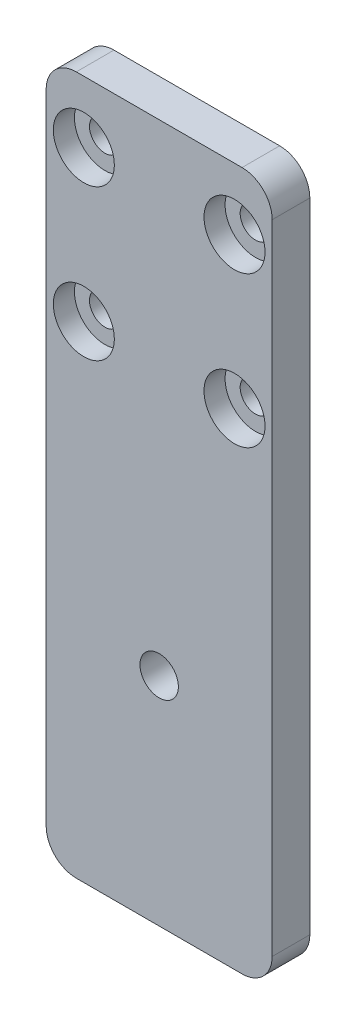
ISO-10303-21;
HEADER;
FILE_DESCRIPTION(('STEP AP214'),'2;1');
FILE_NAME('part.step','',(''),(''),'','','');
FILE_SCHEMA(('AUTOMOTIVE_DESIGN { 1 0 10303 214 1 1 1 1 }'));
ENDSEC;
DATA;
#1=APPLICATION_CONTEXT('core data for automotive mechanical design processes');
#2=APPLICATION_PROTOCOL_DEFINITION('international standard','automotive_design',2000,#1);
#3=PRODUCT_CONTEXT('',#1,'mechanical');
#4=PRODUCT('Part','Part','',(#3));
#5=PRODUCT_RELATED_PRODUCT_CATEGORY('part','',(#4));
#6=PRODUCT_DEFINITION_FORMATION('','',#4);
#7=PRODUCT_DEFINITION_CONTEXT('part definition',#1,'design');
#8=PRODUCT_DEFINITION('design','',#6,#7);
#9=PRODUCT_DEFINITION_SHAPE('','',#8);
#10=(LENGTH_UNIT() NAMED_UNIT(*) SI_UNIT(.MILLI.,.METRE.));
#11=(NAMED_UNIT(*) PLANE_ANGLE_UNIT() SI_UNIT($,.RADIAN.));
#12=(NAMED_UNIT(*) SI_UNIT($,.STERADIAN.) SOLID_ANGLE_UNIT());
#13=UNCERTAINTY_MEASURE_WITH_UNIT(LENGTH_MEASURE(1.E-05),#10,'distance_accuracy_value','');
#14=(GEOMETRIC_REPRESENTATION_CONTEXT(3) GLOBAL_UNCERTAINTY_ASSIGNED_CONTEXT((#13)) GLOBAL_UNIT_ASSIGNED_CONTEXT((#10,
#11,#12)) REPRESENTATION_CONTEXT('',''));
#15=CARTESIAN_POINT('',(0.,0.,0.));
#16=DIRECTION('',(0.,0.,1.));
#17=DIRECTION('',(1.,0.,0.));
#18=AXIS2_PLACEMENT_3D('',#15,#16,#17);
#19=CARTESIAN_POINT('',(25.,66.8,5.));
#20=DIRECTION('',(0.,0.,-1.));
#21=DIRECTION('',(-1.,0.,0.));
#22=AXIS2_PLACEMENT_3D('',#19,#20,#21);
#23=CYLINDRICAL_SURFACE('',#22,2.05);
#24=CARTESIAN_POINT('',(25.,66.8,0.));
#25=DIRECTION('',(0.,0.,1.));
#26=DIRECTION('',(1.,0.,0.));
#27=AXIS2_PLACEMENT_3D('',#24,#25,#26);
#28=CIRCLE('',#27,2.05);
#29=CARTESIAN_POINT('',(27.05,66.8,0.));
#30=VERTEX_POINT('',#29);
#31=EDGE_CURVE('E215',#30,#30,#28,.T.);
#32=ORIENTED_EDGE('',*,*,#31,.F.);
#33=EDGE_LOOP('',(#32));
#34=FACE_BOUND('',#33,.T.);
#35=CARTESIAN_POINT('',(25.,66.8,2.2));
#36=DIRECTION('',(0.,0.,1.));
#37=DIRECTION('',(1.,0.,0.));
#38=AXIS2_PLACEMENT_3D('',#35,#36,#37);
#39=CIRCLE('',#38,2.05);
#40=CARTESIAN_POINT('',(27.05,66.8,2.2));
#41=VERTEX_POINT('',#40);
#42=EDGE_CURVE('E134',#41,#41,#39,.T.);
#43=ORIENTED_EDGE('',*,*,#42,.T.);
#44=EDGE_LOOP('',(#43));
#45=FACE_BOUND('',#44,.T.);
#46=ADVANCED_FACE('F33',(#34,#45),#23,.F.);
#47=CARTESIAN_POINT('',(25.,46.8,5.));
#48=DIRECTION('',(0.,0.,-1.));
#49=DIRECTION('',(-1.,0.,0.));
#50=AXIS2_PLACEMENT_3D('',#47,#48,#49);
#51=CYLINDRICAL_SURFACE('',#50,2.05);
#52=CARTESIAN_POINT('',(25.,46.8,0.));
#53=DIRECTION('',(0.,0.,1.));
#54=DIRECTION('',(1.,0.,0.));
#55=AXIS2_PLACEMENT_3D('',#52,#53,#54);
#56=CIRCLE('',#55,2.05);
#57=CARTESIAN_POINT('',(27.05,46.8,0.));
#58=VERTEX_POINT('',#57);
#59=EDGE_CURVE('E212',#58,#58,#56,.T.);
#60=ORIENTED_EDGE('',*,*,#59,.F.);
#61=EDGE_LOOP('',(#60));
#62=FACE_BOUND('',#61,.T.);
#63=CARTESIAN_POINT('',(25.,46.8,2.2));
#64=DIRECTION('',(0.,0.,1.));
#65=DIRECTION('',(1.,0.,0.));
#66=AXIS2_PLACEMENT_3D('',#63,#64,#65);
#67=CIRCLE('',#66,2.05);
#68=CARTESIAN_POINT('',(27.05,46.8,2.2));
#69=VERTEX_POINT('',#68);
#70=EDGE_CURVE('E179',#69,#69,#67,.T.);
#71=ORIENTED_EDGE('',*,*,#70,.T.);
#72=EDGE_LOOP('',(#71));
#73=FACE_BOUND('',#72,.T.);
#74=ADVANCED_FACE('F251',(#62,#73),#51,.F.);
#75=CARTESIAN_POINT('',(5.,46.8,5.));
#76=DIRECTION('',(0.,0.,-1.));
#77=DIRECTION('',(-1.,0.,0.));
#78=AXIS2_PLACEMENT_3D('',#75,#76,#77);
#79=CYLINDRICAL_SURFACE('',#78,2.05000000000001);
#80=CARTESIAN_POINT('',(5.,46.8,0.));
#81=DIRECTION('',(0.,0.,1.));
#82=DIRECTION('',(1.,0.,0.));
#83=AXIS2_PLACEMENT_3D('',#80,#81,#82);
#84=CIRCLE('',#83,2.05000000000001);
#85=CARTESIAN_POINT('',(7.05,46.8,0.));
#86=VERTEX_POINT('',#85);
#87=EDGE_CURVE('E207',#86,#86,#84,.T.);
#88=ORIENTED_EDGE('',*,*,#87,.F.);
#89=EDGE_LOOP('',(#88));
#90=FACE_BOUND('',#89,.T.);
#91=CARTESIAN_POINT('',(5.,46.8,2.2));
#92=DIRECTION('',(0.,0.,1.));
#93=DIRECTION('',(1.,0.,0.));
#94=AXIS2_PLACEMENT_3D('',#91,#92,#93);
#95=CIRCLE('',#94,2.05000000000001);
#96=CARTESIAN_POINT('',(7.05,46.8,2.2));
#97=VERTEX_POINT('',#96);
#98=EDGE_CURVE('E175',#97,#97,#95,.T.);
#99=ORIENTED_EDGE('',*,*,#98,.T.);
#100=EDGE_LOOP('',(#99));
#101=FACE_BOUND('',#100,.T.);
#102=ADVANCED_FACE('F257',(#90,#101),#79,.F.);
#103=CARTESIAN_POINT('',(5.,66.8,5.));
#104=DIRECTION('',(0.,0.,-1.));
#105=DIRECTION('',(-1.,0.,0.));
#106=AXIS2_PLACEMENT_3D('',#103,#104,#105);
#107=CYLINDRICAL_SURFACE('',#106,2.04999999999999);
#108=CARTESIAN_POINT('',(5.,66.8,0.));
#109=DIRECTION('',(0.,0.,1.));
#110=DIRECTION('',(1.,0.,0.));
#111=AXIS2_PLACEMENT_3D('',#108,#109,#110);
#112=CIRCLE('',#111,2.04999999999999);
#113=CARTESIAN_POINT('',(7.04999999999999,66.8,0.));
#114=VERTEX_POINT('',#113);
#115=EDGE_CURVE('E218',#114,#114,#112,.T.);
#116=ORIENTED_EDGE('',*,*,#115,.F.);
#117=EDGE_LOOP('',(#116));
#118=FACE_BOUND('',#117,.T.);
#119=CARTESIAN_POINT('',(5.,66.8,2.2));
#120=DIRECTION('',(0.,0.,1.));
#121=DIRECTION('',(1.,0.,0.));
#122=AXIS2_PLACEMENT_3D('',#119,#120,#121);
#123=CIRCLE('',#122,2.04999999999999);
#124=CARTESIAN_POINT('',(7.04999999999999,66.8,2.2));
#125=VERTEX_POINT('',#124);
#126=EDGE_CURVE('E170',#125,#125,#123,.T.);
#127=ORIENTED_EDGE('',*,*,#126,.T.);
#128=EDGE_LOOP('',(#127));
#129=FACE_BOUND('',#128,.T.);
#130=ADVANCED_FACE('F263',(#118,#129),#107,.F.);
#131=CARTESIAN_POINT('',(0.,0.,5.));
#132=DIRECTION('',(0.,0.,1.));
#133=DIRECTION('',(1.,0.,0.));
#134=AXIS2_PLACEMENT_3D('',#131,#132,#133);
#135=PLANE('',#134);
#136=CARTESIAN_POINT('',(25.,66.8,5.));
#137=DIRECTION('',(0.,0.,1.));
#138=DIRECTION('',(1.,0.,0.));
#139=AXIS2_PLACEMENT_3D('',#136,#137,#138);
#140=CIRCLE('',#139,4.05);
#141=CARTESIAN_POINT('',(29.05,66.8,5.));
#142=VERTEX_POINT('',#141);
#143=EDGE_CURVE('E195',#142,#142,#140,.T.);
#144=ORIENTED_EDGE('',*,*,#143,.F.);
#145=EDGE_LOOP('',(#144));
#146=FACE_BOUND('',#145,.T.);
#147=CARTESIAN_POINT('',(25.,46.8,5.));
#148=DIRECTION('',(0.,0.,1.));
#149=DIRECTION('',(1.,0.,0.));
#150=AXIS2_PLACEMENT_3D('',#147,#148,#149);
#151=CIRCLE('',#150,4.05);
#152=CARTESIAN_POINT('',(29.05,46.8,5.));
#153=VERTEX_POINT('',#152);
#154=EDGE_CURVE('E188',#153,#153,#151,.T.);
#155=ORIENTED_EDGE('',*,*,#154,.F.);
#156=EDGE_LOOP('',(#155));
#157=FACE_BOUND('',#156,.T.);
#158=CARTESIAN_POINT('',(5.,46.8,5.));
#159=DIRECTION('',(0.,0.,1.));
#160=DIRECTION('',(1.,0.,0.));
#161=AXIS2_PLACEMENT_3D('',#158,#159,#160);
#162=CIRCLE('',#161,4.05);
#163=CARTESIAN_POINT('',(9.05,46.8,5.));
#164=VERTEX_POINT('',#163);
#165=EDGE_CURVE('E181',#164,#164,#162,.T.);
#166=ORIENTED_EDGE('',*,*,#165,.F.);
#167=EDGE_LOOP('',(#166));
#168=FACE_BOUND('',#167,.T.);
#169=CARTESIAN_POINT('',(5.,66.8,5.));
#170=DIRECTION('',(0.,0.,1.));
#171=DIRECTION('',(1.,0.,0.));
#172=AXIS2_PLACEMENT_3D('',#169,#170,#171);
#173=CIRCLE('',#172,4.05);
#174=CARTESIAN_POINT('',(9.05,66.8,5.));
#175=VERTEX_POINT('',#174);
#176=EDGE_CURVE('E177',#175,#175,#173,.T.);
#177=ORIENTED_EDGE('',*,*,#176,.F.);
#178=EDGE_LOOP('',(#177));
#179=FACE_BOUND('',#178,.T.);
#180=DIRECTION('',(1.,0.,0.));
#181=VECTOR('',#180,1.);
#182=CARTESIAN_POINT('',(0.,-17.7,5.));
#183=LINE('',#182,#181);
#184=CARTESIAN_POINT('',(4.,-17.7,5.));
#185=VERTEX_POINT('',#184);
#186=CARTESIAN_POINT('',(26.,-17.7,5.));
#187=VERTEX_POINT('',#186);
#188=EDGE_CURVE('E103',#185,#187,#183,.T.);
#189=ORIENTED_EDGE('',*,*,#188,.T.);
#190=CARTESIAN_POINT('',(26.,-13.7,5.));
#191=DIRECTION('',(0.,0.,1.));
#192=DIRECTION('',(1.,0.,0.));
#193=AXIS2_PLACEMENT_3D('',#190,#191,#192);
#194=CIRCLE('',#193,4.);
#195=CARTESIAN_POINT('',(30.,-13.7,5.));
#196=VERTEX_POINT('',#195);
#197=EDGE_CURVE('E110',#187,#196,#194,.T.);
#198=ORIENTED_EDGE('',*,*,#197,.T.);
#199=DIRECTION('',(0.,1.,0.));
#200=VECTOR('',#199,1.);
#201=CARTESIAN_POINT('',(30.,75.,5.));
#202=LINE('',#201,#200);
#203=CARTESIAN_POINT('',(30.,71.,5.));
#204=VERTEX_POINT('',#203);
#205=EDGE_CURVE('E131',#196,#204,#202,.T.);
#206=ORIENTED_EDGE('',*,*,#205,.T.);
#207=CARTESIAN_POINT('',(26.,71.,5.));
#208=DIRECTION('',(0.,0.,1.));
#209=DIRECTION('',(1.,0.,0.));
#210=AXIS2_PLACEMENT_3D('',#207,#208,#209);
#211=CIRCLE('',#210,4.);
#212=CARTESIAN_POINT('',(26.,75.,5.));
#213=VERTEX_POINT('',#212);
#214=EDGE_CURVE('E128',#204,#213,#211,.T.);
#215=ORIENTED_EDGE('',*,*,#214,.T.);
#216=DIRECTION('',(-1.,0.,0.));
#217=VECTOR('',#216,1.);
#218=CARTESIAN_POINT('',(0.,75.,5.));
#219=LINE('',#218,#217);
#220=CARTESIAN_POINT('',(4.,75.,5.));
#221=VERTEX_POINT('',#220);
#222=EDGE_CURVE('E126',#213,#221,#219,.T.);
#223=ORIENTED_EDGE('',*,*,#222,.T.);
#224=CARTESIAN_POINT('',(4.,71.,5.));
#225=DIRECTION('',(0.,0.,1.));
#226=DIRECTION('',(1.,0.,0.));
#227=AXIS2_PLACEMENT_3D('',#224,#225,#226);
#228=CIRCLE('',#227,4.);
#229=CARTESIAN_POINT('',(0.,71.,5.));
#230=VERTEX_POINT('',#229);
#231=EDGE_CURVE('E111',#221,#230,#228,.T.);
#232=ORIENTED_EDGE('',*,*,#231,.T.);
#233=DIRECTION('',(0.,-1.,0.));
#234=VECTOR('',#233,1.);
#235=CARTESIAN_POINT('',(0.,75.,5.));
#236=LINE('',#235,#234);
#237=CARTESIAN_POINT('',(0.,-13.7,5.));
#238=VERTEX_POINT('',#237);
#239=EDGE_CURVE('E105',#230,#238,#236,.T.);
#240=ORIENTED_EDGE('',*,*,#239,.T.);
#241=CARTESIAN_POINT('',(4.,-13.7,5.));
#242=DIRECTION('',(0.,0.,1.));
#243=DIRECTION('',(1.,0.,0.));
#244=AXIS2_PLACEMENT_3D('',#241,#242,#243);
#245=CIRCLE('',#244,4.);
#246=EDGE_CURVE('E99',#238,#185,#245,.T.);
#247=ORIENTED_EDGE('',*,*,#246,.T.);
#248=EDGE_LOOP('',(#189,#198,#206,#215,#223,#232,#240,#247));
#249=FACE_BOUND('',#248,.T.);
#250=CARTESIAN_POINT('',(15.,11.08,5.));
#251=DIRECTION('',(0.,0.,1.));
#252=DIRECTION('',(1.,0.,0.));
#253=AXIS2_PLACEMENT_3D('',#250,#251,#252);
#254=CIRCLE('',#253,2.54999999999999);
#255=CARTESIAN_POINT('',(17.55,11.08,5.));
#256=VERTEX_POINT('',#255);
#257=EDGE_CURVE('E204',#256,#256,#254,.T.);
#258=ORIENTED_EDGE('',*,*,#257,.F.);
#259=EDGE_LOOP('',(#258));
#260=FACE_BOUND('',#259,.T.);
#261=ADVANCED_FACE('F101',(#146,#157,#168,#179,#249,#260),#135,.T.);
#262=CARTESIAN_POINT('',(0.,0.,0.));
#263=DIRECTION('',(0.,0.,1.));
#264=DIRECTION('',(1.,0.,0.));
#265=AXIS2_PLACEMENT_3D('',#262,#263,#264);
#266=PLANE('',#265);
#267=DIRECTION('',(0.,1.,0.));
#268=VECTOR('',#267,1.);
#269=CARTESIAN_POINT('',(30.,75.,0.));
#270=LINE('',#269,#268);
#271=CARTESIAN_POINT('',(30.,-13.7,0.));
#272=VERTEX_POINT('',#271);
#273=CARTESIAN_POINT('',(30.,71.,0.));
#274=VERTEX_POINT('',#273);
#275=EDGE_CURVE('E163',#272,#274,#270,.T.);
#276=ORIENTED_EDGE('',*,*,#275,.F.);
#277=CARTESIAN_POINT('',(26.,-13.7,0.));
#278=DIRECTION('',(0.,0.,1.));
#279=DIRECTION('',(1.,0.,0.));
#280=AXIS2_PLACEMENT_3D('',#277,#278,#279);
#281=CIRCLE('',#280,4.);
#282=CARTESIAN_POINT('',(26.,-17.7,0.));
#283=VERTEX_POINT('',#282);
#284=EDGE_CURVE('E147',#272,#283,#281,.F.);
#285=ORIENTED_EDGE('',*,*,#284,.T.);
#286=DIRECTION('',(1.,0.,0.));
#287=VECTOR('',#286,1.);
#288=CARTESIAN_POINT('',(0.,-17.7,0.));
#289=LINE('',#288,#287);
#290=CARTESIAN_POINT('',(4.,-17.7,0.));
#291=VERTEX_POINT('',#290);
#292=EDGE_CURVE('E121',#291,#283,#289,.T.);
#293=ORIENTED_EDGE('',*,*,#292,.F.);
#294=CARTESIAN_POINT('',(4.,-13.7,0.));
#295=DIRECTION('',(0.,0.,1.));
#296=DIRECTION('',(1.,0.,0.));
#297=AXIS2_PLACEMENT_3D('',#294,#295,#296);
#298=CIRCLE('',#297,4.);
#299=CARTESIAN_POINT('',(0.,-13.7,0.));
#300=VERTEX_POINT('',#299);
#301=EDGE_CURVE('E125',#291,#300,#298,.F.);
#302=ORIENTED_EDGE('',*,*,#301,.T.);
#303=DIRECTION('',(0.,-1.,0.));
#304=VECTOR('',#303,1.);
#305=CARTESIAN_POINT('',(0.,75.,0.));
#306=LINE('',#305,#304);
#307=CARTESIAN_POINT('',(0.,71.,0.));
#308=VERTEX_POINT('',#307);
#309=EDGE_CURVE('E166',#308,#300,#306,.T.);
#310=ORIENTED_EDGE('',*,*,#309,.F.);
#311=CARTESIAN_POINT('',(4.,71.,0.));
#312=DIRECTION('',(0.,0.,1.));
#313=DIRECTION('',(1.,0.,0.));
#314=AXIS2_PLACEMENT_3D('',#311,#312,#313);
#315=CIRCLE('',#314,4.);
#316=CARTESIAN_POINT('',(4.,75.,0.));
#317=VERTEX_POINT('',#316);
#318=EDGE_CURVE('E48',#308,#317,#315,.F.);
#319=ORIENTED_EDGE('',*,*,#318,.T.);
#320=DIRECTION('',(-1.,0.,0.));
#321=VECTOR('',#320,1.);
#322=CARTESIAN_POINT('',(0.,75.,0.));
#323=LINE('',#322,#321);
#324=CARTESIAN_POINT('',(26.,75.,0.));
#325=VERTEX_POINT('',#324);
#326=EDGE_CURVE('E156',#325,#317,#323,.T.);
#327=ORIENTED_EDGE('',*,*,#326,.F.);
#328=CARTESIAN_POINT('',(26.,71.,0.));
#329=DIRECTION('',(0.,0.,1.));
#330=DIRECTION('',(1.,0.,0.));
#331=AXIS2_PLACEMENT_3D('',#328,#329,#330);
#332=CIRCLE('',#331,4.);
#333=EDGE_CURVE('E56',#325,#274,#332,.F.);
#334=ORIENTED_EDGE('',*,*,#333,.T.);
#335=EDGE_LOOP('',(#276,#285,#293,#302,#310,#319,#327,#334));
#336=FACE_BOUND('',#335,.T.);
#337=ORIENTED_EDGE('',*,*,#115,.T.);
#338=EDGE_LOOP('',(#337));
#339=FACE_BOUND('',#338,.T.);
#340=ORIENTED_EDGE('',*,*,#31,.T.);
#341=EDGE_LOOP('',(#340));
#342=FACE_BOUND('',#341,.T.);
#343=ORIENTED_EDGE('',*,*,#59,.T.);
#344=EDGE_LOOP('',(#343));
#345=FACE_BOUND('',#344,.T.);
#346=ORIENTED_EDGE('',*,*,#87,.T.);
#347=EDGE_LOOP('',(#346));
#348=FACE_BOUND('',#347,.T.);
#349=CARTESIAN_POINT('',(15.,11.08,0.));
#350=DIRECTION('',(0.,0.,1.));
#351=DIRECTION('',(1.,0.,0.));
#352=AXIS2_PLACEMENT_3D('',#349,#350,#351);
#353=CIRCLE('',#352,2.54999999999999);
#354=CARTESIAN_POINT('',(17.55,11.08,0.));
#355=VERTEX_POINT('',#354);
#356=EDGE_CURVE('E173',#355,#355,#353,.T.);
#357=ORIENTED_EDGE('',*,*,#356,.T.);
#358=EDGE_LOOP('',(#357));
#359=FACE_BOUND('',#358,.T.);
#360=ADVANCED_FACE('F160',(#336,#339,#342,#345,#348,#359),#266,.F.);
#361=CARTESIAN_POINT('',(0.,75.,5.));
#362=DIRECTION('',(1.,0.,0.));
#363=DIRECTION('',(0.,1.,0.));
#364=AXIS2_PLACEMENT_3D('',#361,#362,#363);
#365=PLANE('',#364);
#366=ORIENTED_EDGE('',*,*,#309,.T.);
#367=DIRECTION('',(0.,0.,1.));
#368=VECTOR('',#367,1.);
#369=CARTESIAN_POINT('',(0.,-13.7,5.));
#370=LINE('',#369,#368);
#371=EDGE_CURVE('E152',#300,#238,#370,.T.);
#372=ORIENTED_EDGE('',*,*,#371,.T.);
#373=ORIENTED_EDGE('',*,*,#239,.F.);
#374=DIRECTION('',(0.,0.,-1.));
#375=VECTOR('',#374,1.);
#376=CARTESIAN_POINT('',(0.,71.,5.));
#377=LINE('',#376,#375);
#378=EDGE_CURVE('E149',#230,#308,#377,.T.);
#379=ORIENTED_EDGE('',*,*,#378,.T.);
#380=EDGE_LOOP('',(#366,#372,#373,#379));
#381=FACE_BOUND('',#380,.T.);
#382=ADVANCED_FACE('F224',(#381),#365,.F.);
#383=CARTESIAN_POINT('',(30.,75.,5.));
#384=DIRECTION('',(-1.,0.,0.));
#385=DIRECTION('',(0.,-1.,0.));
#386=AXIS2_PLACEMENT_3D('',#383,#384,#385);
#387=PLANE('',#386);
#388=ORIENTED_EDGE('',*,*,#205,.F.);
#389=DIRECTION('',(0.,0.,1.));
#390=VECTOR('',#389,1.);
#391=CARTESIAN_POINT('',(30.,-13.7,0.));
#392=LINE('',#391,#390);
#393=EDGE_CURVE('E142',#196,#272,#392,.F.);
#394=ORIENTED_EDGE('',*,*,#393,.T.);
#395=ORIENTED_EDGE('',*,*,#275,.T.);
#396=DIRECTION('',(0.,0.,-1.));
#397=VECTOR('',#396,1.);
#398=CARTESIAN_POINT('',(30.,71.,5.));
#399=LINE('',#398,#397);
#400=EDGE_CURVE('E140',#274,#204,#399,.F.);
#401=ORIENTED_EDGE('',*,*,#400,.T.);
#402=EDGE_LOOP('',(#388,#394,#395,#401));
#403=FACE_BOUND('',#402,.T.);
#404=ADVANCED_FACE('F275',(#403),#387,.F.);
#405=CARTESIAN_POINT('',(0.,75.,5.));
#406=DIRECTION('',(0.,-1.,0.));
#407=DIRECTION('',(0.,0.,-1.));
#408=AXIS2_PLACEMENT_3D('',#405,#406,#407);
#409=PLANE('',#408);
#410=ORIENTED_EDGE('',*,*,#326,.T.);
#411=DIRECTION('',(0.,0.,-1.));
#412=VECTOR('',#411,1.);
#413=CARTESIAN_POINT('',(4.,75.,5.));
#414=LINE('',#413,#412);
#415=EDGE_CURVE('E11',#317,#221,#414,.F.);
#416=ORIENTED_EDGE('',*,*,#415,.T.);
#417=ORIENTED_EDGE('',*,*,#222,.F.);
#418=DIRECTION('',(0.,0.,-1.));
#419=VECTOR('',#418,1.);
#420=CARTESIAN_POINT('',(26.,75.,5.));
#421=LINE('',#420,#419);
#422=EDGE_CURVE('E41',#213,#325,#421,.T.);
#423=ORIENTED_EDGE('',*,*,#422,.T.);
#424=EDGE_LOOP('',(#410,#416,#417,#423));
#425=FACE_BOUND('',#424,.T.);
#426=ADVANCED_FACE('F155',(#425),#409,.F.);
#427=CARTESIAN_POINT('',(15.,11.08,5.));
#428=DIRECTION('',(0.,0.,-1.));
#429=DIRECTION('',(-1.,0.,0.));
#430=AXIS2_PLACEMENT_3D('',#427,#428,#429);
#431=CYLINDRICAL_SURFACE('',#430,2.54999999999999);
#432=ORIENTED_EDGE('',*,*,#257,.T.);
#433=EDGE_LOOP('',(#432));
#434=FACE_BOUND('',#433,.T.);
#435=ORIENTED_EDGE('',*,*,#356,.F.);
#436=EDGE_LOOP('',(#435));
#437=FACE_BOUND('',#436,.T.);
#438=ADVANCED_FACE('F274',(#434,#437),#431,.F.);
#439=CARTESIAN_POINT('',(5.,66.8,2.2));
#440=DIRECTION('',(0.,0.,1.));
#441=DIRECTION('',(1.,0.,0.));
#442=AXIS2_PLACEMENT_3D('',#439,#440,#441);
#443=CYLINDRICAL_SURFACE('',#442,4.05);
#444=CARTESIAN_POINT('',(5.,66.8,2.2));
#445=DIRECTION('',(0.,0.,1.));
#446=DIRECTION('',(1.,0.,0.));
#447=AXIS2_PLACEMENT_3D('',#444,#445,#446);
#448=CIRCLE('',#447,4.05);
#449=CARTESIAN_POINT('',(9.05,66.8,2.2));
#450=VERTEX_POINT('',#449);
#451=EDGE_CURVE('E174',#450,#450,#448,.T.);
#452=ORIENTED_EDGE('',*,*,#451,.F.);
#453=EDGE_LOOP('',(#452));
#454=FACE_BOUND('',#453,.T.);
#455=ORIENTED_EDGE('',*,*,#176,.T.);
#456=EDGE_LOOP('',(#455));
#457=FACE_BOUND('',#456,.T.);
#458=ADVANCED_FACE('F413',(#454,#457),#443,.F.);
#459=CARTESIAN_POINT('',(5.,66.8,2.2));
#460=DIRECTION('',(0.,0.,1.));
#461=DIRECTION('',(1.,0.,0.));
#462=AXIS2_PLACEMENT_3D('',#459,#460,#461);
#463=PLANE('',#462);
#464=ORIENTED_EDGE('',*,*,#126,.F.);
#465=EDGE_LOOP('',(#464));
#466=FACE_BOUND('',#465,.T.);
#467=ORIENTED_EDGE('',*,*,#451,.T.);
#468=EDGE_LOOP('',(#467));
#469=FACE_BOUND('',#468,.T.);
#470=ADVANCED_FACE('F403',(#466,#469),#463,.T.);
#471=CARTESIAN_POINT('',(5.,46.8,2.2));
#472=DIRECTION('',(0.,0.,1.));
#473=DIRECTION('',(1.,0.,0.));
#474=AXIS2_PLACEMENT_3D('',#471,#472,#473);
#475=CYLINDRICAL_SURFACE('',#474,4.05);
#476=CARTESIAN_POINT('',(5.,46.8,2.2));
#477=DIRECTION('',(0.,0.,1.));
#478=DIRECTION('',(1.,0.,0.));
#479=AXIS2_PLACEMENT_3D('',#476,#477,#478);
#480=CIRCLE('',#479,4.05);
#481=CARTESIAN_POINT('',(9.05,46.8,2.2));
#482=VERTEX_POINT('',#481);
#483=EDGE_CURVE('E178',#482,#482,#480,.T.);
#484=ORIENTED_EDGE('',*,*,#483,.F.);
#485=EDGE_LOOP('',(#484));
#486=FACE_BOUND('',#485,.T.);
#487=ORIENTED_EDGE('',*,*,#165,.T.);
#488=EDGE_LOOP('',(#487));
#489=FACE_BOUND('',#488,.T.);
#490=ADVANCED_FACE('F393',(#486,#489),#475,.F.);
#491=CARTESIAN_POINT('',(5.,46.8,2.2));
#492=DIRECTION('',(0.,0.,1.));
#493=DIRECTION('',(1.,0.,0.));
#494=AXIS2_PLACEMENT_3D('',#491,#492,#493);
#495=PLANE('',#494);
#496=ORIENTED_EDGE('',*,*,#98,.F.);
#497=EDGE_LOOP('',(#496));
#498=FACE_BOUND('',#497,.T.);
#499=ORIENTED_EDGE('',*,*,#483,.T.);
#500=EDGE_LOOP('',(#499));
#501=FACE_BOUND('',#500,.T.);
#502=ADVANCED_FACE('F383',(#498,#501),#495,.T.);
#503=CARTESIAN_POINT('',(25.,46.8,2.2));
#504=DIRECTION('',(0.,0.,1.));
#505=DIRECTION('',(1.,0.,0.));
#506=AXIS2_PLACEMENT_3D('',#503,#504,#505);
#507=CYLINDRICAL_SURFACE('',#506,4.05);
#508=CARTESIAN_POINT('',(25.,46.8,2.2));
#509=DIRECTION('',(0.,0.,1.));
#510=DIRECTION('',(1.,0.,0.));
#511=AXIS2_PLACEMENT_3D('',#508,#509,#510);
#512=CIRCLE('',#511,4.05);
#513=CARTESIAN_POINT('',(29.05,46.8,2.2));
#514=VERTEX_POINT('',#513);
#515=EDGE_CURVE('E182',#514,#514,#512,.T.);
#516=ORIENTED_EDGE('',*,*,#515,.F.);
#517=EDGE_LOOP('',(#516));
#518=FACE_BOUND('',#517,.T.);
#519=ORIENTED_EDGE('',*,*,#154,.T.);
#520=EDGE_LOOP('',(#519));
#521=FACE_BOUND('',#520,.T.);
#522=ADVANCED_FACE('F373',(#518,#521),#507,.F.);
#523=CARTESIAN_POINT('',(25.,46.8,2.2));
#524=DIRECTION('',(0.,0.,1.));
#525=DIRECTION('',(1.,0.,0.));
#526=AXIS2_PLACEMENT_3D('',#523,#524,#525);
#527=PLANE('',#526);
#528=ORIENTED_EDGE('',*,*,#70,.F.);
#529=EDGE_LOOP('',(#528));
#530=FACE_BOUND('',#529,.T.);
#531=ORIENTED_EDGE('',*,*,#515,.T.);
#532=EDGE_LOOP('',(#531));
#533=FACE_BOUND('',#532,.T.);
#534=ADVANCED_FACE('F247',(#530,#533),#527,.T.);
#535=CARTESIAN_POINT('',(25.,66.8,2.2));
#536=DIRECTION('',(0.,0.,1.));
#537=DIRECTION('',(1.,0.,0.));
#538=AXIS2_PLACEMENT_3D('',#535,#536,#537);
#539=CYLINDRICAL_SURFACE('',#538,4.05);
#540=CARTESIAN_POINT('',(25.,66.8,2.2));
#541=DIRECTION('',(0.,0.,1.));
#542=DIRECTION('',(1.,0.,0.));
#543=AXIS2_PLACEMENT_3D('',#540,#541,#542);
#544=CIRCLE('',#543,4.05);
#545=CARTESIAN_POINT('',(29.05,66.8,2.2));
#546=VERTEX_POINT('',#545);
#547=EDGE_CURVE('E229',#546,#546,#544,.T.);
#548=ORIENTED_EDGE('',*,*,#547,.F.);
#549=EDGE_LOOP('',(#548));
#550=FACE_BOUND('',#549,.T.);
#551=ORIENTED_EDGE('',*,*,#143,.T.);
#552=EDGE_LOOP('',(#551));
#553=FACE_BOUND('',#552,.T.);
#554=ADVANCED_FACE('F239',(#550,#553),#539,.F.);
#555=CARTESIAN_POINT('',(25.,66.8,2.2));
#556=DIRECTION('',(0.,0.,1.));
#557=DIRECTION('',(1.,0.,0.));
#558=AXIS2_PLACEMENT_3D('',#555,#556,#557);
#559=PLANE('',#558);
#560=ORIENTED_EDGE('',*,*,#42,.F.);
#561=EDGE_LOOP('',(#560));
#562=FACE_BOUND('',#561,.T.);
#563=ORIENTED_EDGE('',*,*,#547,.T.);
#564=EDGE_LOOP('',(#563));
#565=FACE_BOUND('',#564,.T.);
#566=ADVANCED_FACE('F237',(#562,#565),#559,.T.);
#567=CARTESIAN_POINT('',(0.,-17.7,0.));
#568=DIRECTION('',(0.,-1.,0.));
#569=DIRECTION('',(0.,0.,-1.));
#570=AXIS2_PLACEMENT_3D('',#567,#568,#569);
#571=PLANE('',#570);
#572=ORIENTED_EDGE('',*,*,#292,.T.);
#573=DIRECTION('',(0.,0.,1.));
#574=VECTOR('',#573,1.);
#575=CARTESIAN_POINT('',(26.,-17.7,5.));
#576=LINE('',#575,#574);
#577=EDGE_CURVE('E120',#283,#187,#576,.T.);
#578=ORIENTED_EDGE('',*,*,#577,.T.);
#579=ORIENTED_EDGE('',*,*,#188,.F.);
#580=DIRECTION('',(0.,0.,1.));
#581=VECTOR('',#580,1.);
#582=CARTESIAN_POINT('',(4.,-17.7,0.));
#583=LINE('',#582,#581);
#584=EDGE_CURVE('E117',#185,#291,#583,.F.);
#585=ORIENTED_EDGE('',*,*,#584,.T.);
#586=EDGE_LOOP('',(#572,#578,#579,#585));
#587=FACE_BOUND('',#586,.T.);
#588=ADVANCED_FACE('F116',(#587),#571,.T.);
#589=CARTESIAN_POINT('',(26.,-13.7,0.));
#590=DIRECTION('',(0.,0.,-1.));
#591=DIRECTION('',(-1.,0.,0.));
#592=AXIS2_PLACEMENT_3D('',#589,#590,#591);
#593=CYLINDRICAL_SURFACE('',#592,4.);
#594=ORIENTED_EDGE('',*,*,#284,.F.);
#595=ORIENTED_EDGE('',*,*,#393,.F.);
#596=ORIENTED_EDGE('',*,*,#197,.F.);
#597=ORIENTED_EDGE('',*,*,#577,.F.);
#598=EDGE_LOOP('',(#594,#595,#596,#597));
#599=FACE_BOUND('',#598,.T.);
#600=ADVANCED_FACE('F245',(#599),#593,.T.);
#601=CARTESIAN_POINT('',(4.,-13.7,5.));
#602=DIRECTION('',(0.,0.,-1.));
#603=DIRECTION('',(-1.,0.,0.));
#604=AXIS2_PLACEMENT_3D('',#601,#602,#603);
#605=CYLINDRICAL_SURFACE('',#604,4.);
#606=ORIENTED_EDGE('',*,*,#301,.F.);
#607=ORIENTED_EDGE('',*,*,#584,.F.);
#608=ORIENTED_EDGE('',*,*,#246,.F.);
#609=ORIENTED_EDGE('',*,*,#371,.F.);
#610=EDGE_LOOP('',(#606,#607,#608,#609));
#611=FACE_BOUND('',#610,.T.);
#612=ADVANCED_FACE('F124',(#611),#605,.T.);
#613=CARTESIAN_POINT('',(4.,71.,5.));
#614=DIRECTION('',(0.,0.,-1.));
#615=DIRECTION('',(-1.,0.,0.));
#616=AXIS2_PLACEMENT_3D('',#613,#614,#615);
#617=CYLINDRICAL_SURFACE('',#616,4.);
#618=ORIENTED_EDGE('',*,*,#231,.F.);
#619=ORIENTED_EDGE('',*,*,#415,.F.);
#620=ORIENTED_EDGE('',*,*,#318,.F.);
#621=ORIENTED_EDGE('',*,*,#378,.F.);
#622=EDGE_LOOP('',(#618,#619,#620,#621));
#623=FACE_BOUND('',#622,.T.);
#624=ADVANCED_FACE('F285',(#623),#617,.T.);
#625=CARTESIAN_POINT('',(26.,71.,5.));
#626=DIRECTION('',(0.,0.,-1.));
#627=DIRECTION('',(-1.,0.,0.));
#628=AXIS2_PLACEMENT_3D('',#625,#626,#627);
#629=CYLINDRICAL_SURFACE('',#628,4.);
#630=ORIENTED_EDGE('',*,*,#214,.F.);
#631=ORIENTED_EDGE('',*,*,#400,.F.);
#632=ORIENTED_EDGE('',*,*,#333,.F.);
#633=ORIENTED_EDGE('',*,*,#422,.F.);
#634=EDGE_LOOP('',(#630,#631,#632,#633));
#635=FACE_BOUND('',#634,.T.);
#636=ADVANCED_FACE('F35',(#635),#629,.T.);
#637=CLOSED_SHELL('',(#46,#74,#102,#130,#261,#360,#382,#404,#426,#438,#458,#470,#490,#502,#522,
#534,#554,#566,#588,#600,#612,#624,#636));
#638=MANIFOLD_SOLID_BREP('B2',#637);
#639=ADVANCED_BREP_SHAPE_REPRESENTATION('',(#18,#638),#14);
#640=SHAPE_DEFINITION_REPRESENTATION(#9,#639);
ENDSEC;
END-ISO-10303-21;
